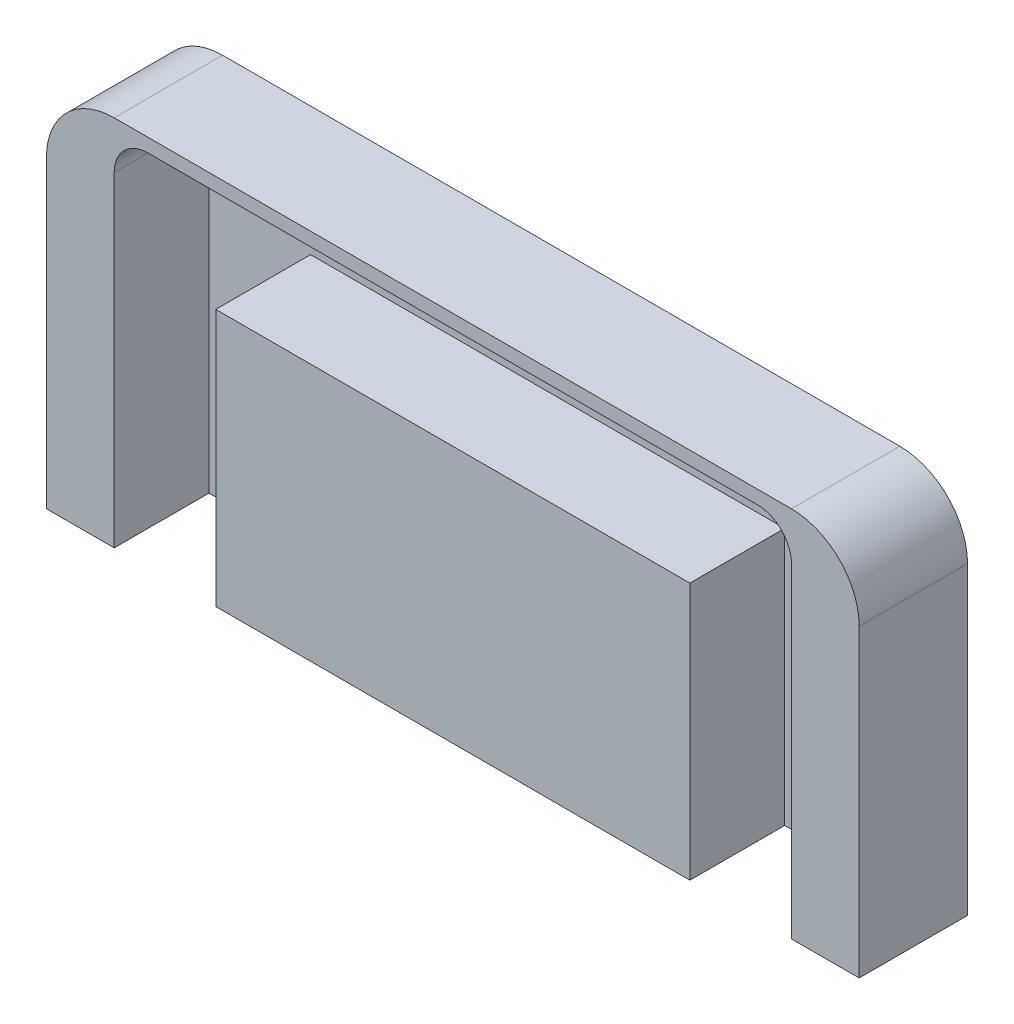
ISO-10303-21;
HEADER;
FILE_DESCRIPTION(('STEP AP214'),'2;1');
FILE_NAME('part.step','',(''),(''),'','','');
FILE_SCHEMA(('AUTOMOTIVE_DESIGN { 1 0 10303 214 1 1 1 1 }'));
ENDSEC;
DATA;
#1=APPLICATION_CONTEXT('core data for automotive mechanical design processes');
#2=APPLICATION_PROTOCOL_DEFINITION('international standard','automotive_design',2000,#1);
#3=PRODUCT_CONTEXT('',#1,'mechanical');
#4=PRODUCT('Part','Part','',(#3));
#5=PRODUCT_RELATED_PRODUCT_CATEGORY('part','',(#4));
#6=PRODUCT_DEFINITION_FORMATION('','',#4);
#7=PRODUCT_DEFINITION_CONTEXT('part definition',#1,'design');
#8=PRODUCT_DEFINITION('design','',#6,#7);
#9=PRODUCT_DEFINITION_SHAPE('','',#8);
#10=(LENGTH_UNIT() NAMED_UNIT(*) SI_UNIT(.MILLI.,.METRE.));
#11=(NAMED_UNIT(*) PLANE_ANGLE_UNIT() SI_UNIT($,.RADIAN.));
#12=(NAMED_UNIT(*) SI_UNIT($,.STERADIAN.) SOLID_ANGLE_UNIT());
#13=UNCERTAINTY_MEASURE_WITH_UNIT(LENGTH_MEASURE(1.E-05),#10,'distance_accuracy_value','');
#14=(GEOMETRIC_REPRESENTATION_CONTEXT(3) GLOBAL_UNCERTAINTY_ASSIGNED_CONTEXT((#13)) GLOBAL_UNIT_ASSIGNED_CONTEXT((#10,
#11,#12)) REPRESENTATION_CONTEXT('',''));
#15=CARTESIAN_POINT('',(0.,0.,0.));
#16=DIRECTION('',(0.,0.,1.));
#17=DIRECTION('',(1.,0.,0.));
#18=AXIS2_PLACEMENT_3D('',#15,#16,#17);
#19=CARTESIAN_POINT('',(0.,0.,3.2));
#20=DIRECTION('',(0.,0.,-1.));
#21=DIRECTION('',(-1.,0.,0.));
#22=AXIS2_PLACEMENT_3D('',#19,#20,#21);
#23=PLANE('',#22);
#24=DIRECTION('',(0.,1.,0.));
#25=VECTOR('',#24,1.);
#26=CARTESIAN_POINT('',(23.3144024959609,0.,3.2));
#27=LINE('',#26,#25);
#28=CARTESIAN_POINT('',(23.3144024959609,0.,3.2));
#29=VERTEX_POINT('',#28);
#30=CARTESIAN_POINT('',(23.3144024959609,9.,3.2));
#31=VERTEX_POINT('',#30);
#32=EDGE_CURVE('E198',#29,#31,#27,.T.);
#33=ORIENTED_EDGE('',*,*,#32,.T.);
#34=CARTESIAN_POINT('',(21.3144024959609,9.,3.2));
#35=DIRECTION('',(0.,0.,-1.));
#36=DIRECTION('',(-1.,0.,0.));
#37=AXIS2_PLACEMENT_3D('',#34,#35,#36);
#38=CIRCLE('',#37,2.);
#39=CARTESIAN_POINT('',(21.3144024959609,11.,3.2));
#40=VERTEX_POINT('',#39);
#41=EDGE_CURVE('E232',#31,#40,#38,.F.);
#42=ORIENTED_EDGE('',*,*,#41,.T.);
#43=DIRECTION('',(-1.,0.,0.));
#44=VECTOR('',#43,1.);
#45=CARTESIAN_POINT('',(-0.685597504039103,11.,3.2));
#46=LINE('',#45,#44);
#47=CARTESIAN_POINT('',(1.3144024959609,11.,3.2));
#48=VERTEX_POINT('',#47);
#49=EDGE_CURVE('E202',#40,#48,#46,.T.);
#50=ORIENTED_EDGE('',*,*,#49,.T.);
#51=CARTESIAN_POINT('',(1.3144024959609,9.,3.2));
#52=DIRECTION('',(0.,0.,-1.));
#53=DIRECTION('',(-1.,0.,0.));
#54=AXIS2_PLACEMENT_3D('',#51,#52,#53);
#55=CIRCLE('',#54,2.);
#56=CARTESIAN_POINT('',(-0.685597504039103,9.,3.2));
#57=VERTEX_POINT('',#56);
#58=EDGE_CURVE('E230',#48,#57,#55,.F.);
#59=ORIENTED_EDGE('',*,*,#58,.T.);
#60=DIRECTION('',(0.,-1.,0.));
#61=VECTOR('',#60,1.);
#62=CARTESIAN_POINT('',(-0.685597504039103,0.,3.2));
#63=LINE('',#62,#61);
#64=CARTESIAN_POINT('',(-0.685597504039103,0.,3.2));
#65=VERTEX_POINT('',#64);
#66=EDGE_CURVE('E191',#57,#65,#63,.T.);
#67=ORIENTED_EDGE('',*,*,#66,.T.);
#68=DIRECTION('',(1.,0.,0.));
#69=VECTOR('',#68,1.);
#70=CARTESIAN_POINT('',(-0.685597504039103,0.,3.2));
#71=LINE('',#70,#69);
#72=CARTESIAN_POINT('',(1.31440249596088,0.,3.2));
#73=VERTEX_POINT('',#72);
#74=EDGE_CURVE('E195',#65,#73,#71,.T.);
#75=ORIENTED_EDGE('',*,*,#74,.T.);
#76=DIRECTION('',(0.,-1.,0.));
#77=VECTOR('',#76,1.);
#78=CARTESIAN_POINT('',(1.31440249596088,7.6,3.2));
#79=LINE('',#78,#77);
#80=CARTESIAN_POINT('',(1.31440249596088,9.6,3.2));
#81=VERTEX_POINT('',#80);
#82=EDGE_CURVE('E182',#81,#73,#79,.T.);
#83=ORIENTED_EDGE('',*,*,#82,.F.);
#84=CARTESIAN_POINT('',(2.31440249596088,9.6,3.2));
#85=DIRECTION('',(0.,0.,-1.));
#86=DIRECTION('',(-1.,0.,0.));
#87=AXIS2_PLACEMENT_3D('',#84,#85,#86);
#88=CIRCLE('',#87,1.);
#89=CARTESIAN_POINT('',(2.31440249596088,10.6,3.2));
#90=VERTEX_POINT('',#89);
#91=EDGE_CURVE('E11',#81,#90,#88,.T.);
#92=ORIENTED_EDGE('',*,*,#91,.T.);
#93=DIRECTION('',(-1.,0.,0.));
#94=VECTOR('',#93,1.);
#95=CARTESIAN_POINT('',(21.3144024959609,10.6,3.2));
#96=LINE('',#95,#94);
#97=CARTESIAN_POINT('',(20.3144024959609,10.6,3.2));
#98=VERTEX_POINT('',#97);
#99=EDGE_CURVE('E176',#98,#90,#96,.T.);
#100=ORIENTED_EDGE('',*,*,#99,.F.);
#101=CARTESIAN_POINT('',(20.3144024959609,9.6,3.2));
#102=DIRECTION('',(0.,0.,-1.));
#103=DIRECTION('',(-1.,0.,0.));
#104=AXIS2_PLACEMENT_3D('',#101,#102,#103);
#105=CIRCLE('',#104,1.);
#106=CARTESIAN_POINT('',(21.3144024959609,9.6,3.2));
#107=VERTEX_POINT('',#106);
#108=EDGE_CURVE('E40',#98,#107,#105,.T.);
#109=ORIENTED_EDGE('',*,*,#108,.T.);
#110=DIRECTION('',(0.,1.,0.));
#111=VECTOR('',#110,1.);
#112=CARTESIAN_POINT('',(21.3144024959609,7.6,3.2));
#113=LINE('',#112,#111);
#114=CARTESIAN_POINT('',(21.3144024959609,0.,3.2));
#115=VERTEX_POINT('',#114);
#116=EDGE_CURVE('E186',#115,#107,#113,.T.);
#117=ORIENTED_EDGE('',*,*,#116,.F.);
#118=EDGE_CURVE('E193',#115,#29,#71,.T.);
#119=ORIENTED_EDGE('',*,*,#118,.T.);
#120=EDGE_LOOP('',(#33,#42,#50,#59,#67,#75,#83,#92,#100,#109,#117,#119));
#121=FACE_BOUND('',#120,.T.);
#122=ADVANCED_FACE('F32',(#121),#23,.F.);
#123=CARTESIAN_POINT('',(-0.685597504039103,0.,3.2));
#124=DIRECTION('',(1.,0.,0.));
#125=DIRECTION('',(0.,0.,-1.));
#126=AXIS2_PLACEMENT_3D('',#123,#124,#125);
#127=PLANE('',#126);
#128=ORIENTED_EDGE('',*,*,#66,.F.);
#129=DIRECTION('',(0.,0.,-1.));
#130=VECTOR('',#129,1.);
#131=CARTESIAN_POINT('',(-0.685597504039103,9.,3.2));
#132=LINE('',#131,#130);
#133=CARTESIAN_POINT('',(-0.685597504039103,9.,0.));
#134=VERTEX_POINT('',#133);
#135=EDGE_CURVE('E234',#57,#134,#132,.T.);
#136=ORIENTED_EDGE('',*,*,#135,.T.);
#137=DIRECTION('',(0.,-1.,0.));
#138=VECTOR('',#137,1.);
#139=CARTESIAN_POINT('',(-0.685597504039103,0.,0.));
#140=LINE('',#139,#138);
#141=CARTESIAN_POINT('',(-0.685597504039103,0.,0.));
#142=VERTEX_POINT('',#141);
#143=EDGE_CURVE('E181',#134,#142,#140,.T.);
#144=ORIENTED_EDGE('',*,*,#143,.T.);
#145=DIRECTION('',(0.,0.,-1.));
#146=VECTOR('',#145,1.);
#147=CARTESIAN_POINT('',(-0.685597504039103,0.,3.2));
#148=LINE('',#147,#146);
#149=EDGE_CURVE('E216',#65,#142,#148,.T.);
#150=ORIENTED_EDGE('',*,*,#149,.F.);
#151=EDGE_LOOP('',(#128,#136,#144,#150));
#152=FACE_BOUND('',#151,.T.);
#153=ADVANCED_FACE('F276',(#152),#127,.F.);
#154=CARTESIAN_POINT('',(-0.685597504039103,0.,3.2));
#155=DIRECTION('',(0.,1.,0.));
#156=DIRECTION('',(0.,0.,1.));
#157=AXIS2_PLACEMENT_3D('',#154,#155,#156);
#158=PLANE('',#157);
#159=ORIENTED_EDGE('',*,*,#118,.F.);
#160=DIRECTION('',(0.,0.,1.));
#161=VECTOR('',#160,1.);
#162=CARTESIAN_POINT('',(21.3144024959609,0.,0.4));
#163=LINE('',#162,#161);
#164=CARTESIAN_POINT('',(21.3144024959609,0.,0.4));
#165=VERTEX_POINT('',#164);
#166=EDGE_CURVE('E184',#165,#115,#163,.T.);
#167=ORIENTED_EDGE('',*,*,#166,.F.);
#168=DIRECTION('',(1.,0.,0.));
#169=VECTOR('',#168,1.);
#170=CARTESIAN_POINT('',(21.3144024959609,0.,0.4));
#171=LINE('',#170,#169);
#172=CARTESIAN_POINT('',(18.3144024959609,0.,0.4));
#173=VERTEX_POINT('',#172);
#174=EDGE_CURVE('E154',#173,#165,#171,.T.);
#175=ORIENTED_EDGE('',*,*,#174,.F.);
#176=DIRECTION('',(0.,0.,1.));
#177=VECTOR('',#176,1.);
#178=CARTESIAN_POINT('',(18.3144024959609,0.,0.4));
#179=LINE('',#178,#177);
#180=CARTESIAN_POINT('',(18.3144024959609,0.,3.2));
#181=VERTEX_POINT('',#180);
#182=EDGE_CURVE('E150',#173,#181,#179,.T.);
#183=ORIENTED_EDGE('',*,*,#182,.T.);
#184=CARTESIAN_POINT('',(4.31440249596088,0.,3.2));
#185=VERTEX_POINT('',#184);
#186=EDGE_CURVE('E199',#185,#181,#71,.T.);
#187=ORIENTED_EDGE('',*,*,#186,.F.);
#188=DIRECTION('',(0.,0.,1.));
#189=VECTOR('',#188,1.);
#190=CARTESIAN_POINT('',(4.31440249596088,0.,0.4));
#191=LINE('',#190,#189);
#192=CARTESIAN_POINT('',(4.31440249596088,0.,0.4));
#193=VERTEX_POINT('',#192);
#194=EDGE_CURVE('E328',#193,#185,#191,.T.);
#195=ORIENTED_EDGE('',*,*,#194,.F.);
#196=DIRECTION('',(1.,0.,0.));
#197=VECTOR('',#196,1.);
#198=CARTESIAN_POINT('',(1.31440249596088,0.,0.4));
#199=LINE('',#198,#197);
#200=CARTESIAN_POINT('',(1.31440249596088,0.,0.4));
#201=VERTEX_POINT('',#200);
#202=EDGE_CURVE('E333',#201,#193,#199,.T.);
#203=ORIENTED_EDGE('',*,*,#202,.F.);
#204=DIRECTION('',(0.,0.,1.));
#205=VECTOR('',#204,1.);
#206=CARTESIAN_POINT('',(1.31440249596088,0.,0.4));
#207=LINE('',#206,#205);
#208=EDGE_CURVE('E274',#201,#73,#207,.T.);
#209=ORIENTED_EDGE('',*,*,#208,.T.);
#210=ORIENTED_EDGE('',*,*,#74,.F.);
#211=ORIENTED_EDGE('',*,*,#149,.T.);
#212=DIRECTION('',(1.,0.,0.));
#213=VECTOR('',#212,1.);
#214=CARTESIAN_POINT('',(-0.685597504039103,0.,0.));
#215=LINE('',#214,#213);
#216=CARTESIAN_POINT('',(23.3144024959609,0.,0.));
#217=VERTEX_POINT('',#216);
#218=EDGE_CURVE('E207',#142,#217,#215,.T.);
#219=ORIENTED_EDGE('',*,*,#218,.T.);
#220=DIRECTION('',(0.,0.,-1.));
#221=VECTOR('',#220,1.);
#222=CARTESIAN_POINT('',(23.3144024959609,0.,3.2));
#223=LINE('',#222,#221);
#224=EDGE_CURVE('E205',#29,#217,#223,.T.);
#225=ORIENTED_EDGE('',*,*,#224,.F.);
#226=EDGE_LOOP('',(#159,#167,#175,#183,#187,#195,#203,#209,#210,#211,#219,#225));
#227=FACE_BOUND('',#226,.T.);
#228=ADVANCED_FACE('F272',(#227),#158,.F.);
#229=CARTESIAN_POINT('',(23.3144024959609,0.,3.2));
#230=DIRECTION('',(-1.,0.,0.));
#231=DIRECTION('',(0.,0.,1.));
#232=AXIS2_PLACEMENT_3D('',#229,#230,#231);
#233=PLANE('',#232);
#234=DIRECTION('',(0.,1.,0.));
#235=VECTOR('',#234,1.);
#236=CARTESIAN_POINT('',(23.3144024959609,0.,0.));
#237=LINE('',#236,#235);
#238=CARTESIAN_POINT('',(23.3144024959609,9.,0.));
#239=VERTEX_POINT('',#238);
#240=EDGE_CURVE('E209',#217,#239,#237,.T.);
#241=ORIENTED_EDGE('',*,*,#240,.T.);
#242=DIRECTION('',(0.,0.,-1.));
#243=VECTOR('',#242,1.);
#244=CARTESIAN_POINT('',(23.3144024959609,9.,3.2));
#245=LINE('',#244,#243);
#246=EDGE_CURVE('E228',#239,#31,#245,.F.);
#247=ORIENTED_EDGE('',*,*,#246,.T.);
#248=ORIENTED_EDGE('',*,*,#32,.F.);
#249=ORIENTED_EDGE('',*,*,#224,.T.);
#250=EDGE_LOOP('',(#241,#247,#248,#249));
#251=FACE_BOUND('',#250,.T.);
#252=ADVANCED_FACE('F287',(#251),#233,.F.);
#253=CARTESIAN_POINT('',(-0.685597504039103,11.,3.2));
#254=DIRECTION('',(0.,-1.,0.));
#255=DIRECTION('',(0.,0.,-1.));
#256=AXIS2_PLACEMENT_3D('',#253,#254,#255);
#257=PLANE('',#256);
#258=ORIENTED_EDGE('',*,*,#49,.F.);
#259=DIRECTION('',(0.,0.,-1.));
#260=VECTOR('',#259,1.);
#261=CARTESIAN_POINT('',(21.3144024959609,11.,3.2));
#262=LINE('',#261,#260);
#263=CARTESIAN_POINT('',(21.3144024959609,11.,0.));
#264=VERTEX_POINT('',#263);
#265=EDGE_CURVE('E221',#40,#264,#262,.T.);
#266=ORIENTED_EDGE('',*,*,#265,.T.);
#267=DIRECTION('',(-1.,0.,0.));
#268=VECTOR('',#267,1.);
#269=CARTESIAN_POINT('',(-0.685597504039103,11.,0.));
#270=LINE('',#269,#268);
#271=CARTESIAN_POINT('',(1.3144024959609,11.,0.));
#272=VERTEX_POINT('',#271);
#273=EDGE_CURVE('E194',#264,#272,#270,.T.);
#274=ORIENTED_EDGE('',*,*,#273,.T.);
#275=DIRECTION('',(0.,0.,-1.));
#276=VECTOR('',#275,1.);
#277=CARTESIAN_POINT('',(1.3144024959609,11.,3.2));
#278=LINE('',#277,#276);
#279=EDGE_CURVE('E219',#272,#48,#278,.F.);
#280=ORIENTED_EDGE('',*,*,#279,.T.);
#281=EDGE_LOOP('',(#258,#266,#274,#280));
#282=FACE_BOUND('',#281,.T.);
#283=ADVANCED_FACE('F295',(#282),#257,.F.);
#284=ORIENTED_EDGE('',*,*,#186,.T.);
#285=DIRECTION('',(0.,-1.,0.));
#286=VECTOR('',#285,1.);
#287=CARTESIAN_POINT('',(18.3144024959609,7.6,3.2));
#288=LINE('',#287,#286);
#289=CARTESIAN_POINT('',(18.3144024959609,7.6,3.2));
#290=VERTEX_POINT('',#289);
#291=EDGE_CURVE('E155',#290,#181,#288,.T.);
#292=ORIENTED_EDGE('',*,*,#291,.F.);
#293=DIRECTION('',(1.,0.,0.));
#294=VECTOR('',#293,1.);
#295=CARTESIAN_POINT('',(21.3144024959609,7.6,3.2));
#296=LINE('',#295,#294);
#297=CARTESIAN_POINT('',(4.31440249596088,7.6,3.2));
#298=VERTEX_POINT('',#297);
#299=EDGE_CURVE('E164',#298,#290,#296,.T.);
#300=ORIENTED_EDGE('',*,*,#299,.F.);
#301=DIRECTION('',(0.,1.,0.));
#302=VECTOR('',#301,1.);
#303=CARTESIAN_POINT('',(4.31440249596088,7.6,3.2));
#304=LINE('',#303,#302);
#305=EDGE_CURVE('E326',#185,#298,#304,.T.);
#306=ORIENTED_EDGE('',*,*,#305,.F.);
#307=EDGE_LOOP('',(#284,#292,#300,#306));
#308=FACE_BOUND('',#307,.T.);
#309=ADVANCED_FACE('F309',(#308),#23,.F.);
#310=CARTESIAN_POINT('',(0.,0.,0.));
#311=DIRECTION('',(0.,0.,-1.));
#312=DIRECTION('',(-1.,0.,0.));
#313=AXIS2_PLACEMENT_3D('',#310,#311,#312);
#314=PLANE('',#313);
#315=ORIENTED_EDGE('',*,*,#273,.F.);
#316=CARTESIAN_POINT('',(21.3144024959609,9.,0.));
#317=DIRECTION('',(0.,0.,-1.));
#318=DIRECTION('',(-1.,0.,0.));
#319=AXIS2_PLACEMENT_3D('',#316,#317,#318);
#320=CIRCLE('',#319,2.);
#321=EDGE_CURVE('E226',#264,#239,#320,.T.);
#322=ORIENTED_EDGE('',*,*,#321,.T.);
#323=ORIENTED_EDGE('',*,*,#240,.F.);
#324=ORIENTED_EDGE('',*,*,#218,.F.);
#325=ORIENTED_EDGE('',*,*,#143,.F.);
#326=CARTESIAN_POINT('',(1.3144024959609,9.,0.));
#327=DIRECTION('',(0.,0.,-1.));
#328=DIRECTION('',(-1.,0.,0.));
#329=AXIS2_PLACEMENT_3D('',#326,#327,#328);
#330=CIRCLE('',#329,2.);
#331=EDGE_CURVE('E224',#134,#272,#330,.T.);
#332=ORIENTED_EDGE('',*,*,#331,.T.);
#333=EDGE_LOOP('',(#315,#322,#323,#324,#325,#332));
#334=FACE_BOUND('',#333,.T.);
#335=ADVANCED_FACE('F283',(#334),#314,.T.);
#336=CARTESIAN_POINT('',(1.31440249596088,7.6,0.4));
#337=DIRECTION('',(-1.,0.,0.));
#338=DIRECTION('',(0.,0.,1.));
#339=AXIS2_PLACEMENT_3D('',#336,#337,#338);
#340=PLANE('',#339);
#341=DIRECTION('',(0.,-1.,0.));
#342=VECTOR('',#341,1.);
#343=CARTESIAN_POINT('',(1.31440249596088,7.6,0.4));
#344=LINE('',#343,#342);
#345=CARTESIAN_POINT('',(1.31440249596088,9.6,0.4));
#346=VERTEX_POINT('',#345);
#347=EDGE_CURVE('E172',#346,#201,#344,.T.);
#348=ORIENTED_EDGE('',*,*,#347,.F.);
#349=DIRECTION('',(0.,0.,1.));
#350=VECTOR('',#349,1.);
#351=CARTESIAN_POINT('',(1.31440249596088,9.6,3.2));
#352=LINE('',#351,#350);
#353=EDGE_CURVE('E247',#346,#81,#352,.T.);
#354=ORIENTED_EDGE('',*,*,#353,.T.);
#355=ORIENTED_EDGE('',*,*,#82,.T.);
#356=ORIENTED_EDGE('',*,*,#208,.F.);
#357=EDGE_LOOP('',(#348,#354,#355,#356));
#358=FACE_BOUND('',#357,.T.);
#359=ADVANCED_FACE('F265',(#358),#340,.F.);
#360=CARTESIAN_POINT('',(21.3144024959609,10.6,0.4));
#361=DIRECTION('',(0.,1.,0.));
#362=DIRECTION('',(0.,0.,1.));
#363=AXIS2_PLACEMENT_3D('',#360,#361,#362);
#364=PLANE('',#363);
#365=DIRECTION('',(-1.,0.,0.));
#366=VECTOR('',#365,1.);
#367=CARTESIAN_POINT('',(21.3144024959609,10.6,0.4));
#368=LINE('',#367,#366);
#369=CARTESIAN_POINT('',(20.3144024959609,10.6,0.4));
#370=VERTEX_POINT('',#369);
#371=CARTESIAN_POINT('',(2.31440249596088,10.6,0.4));
#372=VERTEX_POINT('',#371);
#373=EDGE_CURVE('E174',#370,#372,#368,.T.);
#374=ORIENTED_EDGE('',*,*,#373,.F.);
#375=DIRECTION('',(0.,0.,1.));
#376=VECTOR('',#375,1.);
#377=CARTESIAN_POINT('',(20.3144024959609,10.6,3.2));
#378=LINE('',#377,#376);
#379=EDGE_CURVE('E239',#370,#98,#378,.T.);
#380=ORIENTED_EDGE('',*,*,#379,.T.);
#381=ORIENTED_EDGE('',*,*,#99,.T.);
#382=DIRECTION('',(0.,0.,1.));
#383=VECTOR('',#382,1.);
#384=CARTESIAN_POINT('',(2.31440249596088,10.6,0.4));
#385=LINE('',#384,#383);
#386=EDGE_CURVE('E237',#90,#372,#385,.F.);
#387=ORIENTED_EDGE('',*,*,#386,.T.);
#388=EDGE_LOOP('',(#374,#380,#381,#387));
#389=FACE_BOUND('',#388,.T.);
#390=ADVANCED_FACE('F262',(#389),#364,.F.);
#391=CARTESIAN_POINT('',(21.3144024959609,7.6,0.4));
#392=DIRECTION('',(1.,0.,0.));
#393=DIRECTION('',(0.,0.,-1.));
#394=AXIS2_PLACEMENT_3D('',#391,#392,#393);
#395=PLANE('',#394);
#396=ORIENTED_EDGE('',*,*,#116,.T.);
#397=DIRECTION('',(0.,0.,1.));
#398=VECTOR('',#397,1.);
#399=CARTESIAN_POINT('',(21.3144024959609,9.6,0.4));
#400=LINE('',#399,#398);
#401=CARTESIAN_POINT('',(21.3144024959609,9.6,0.4));
#402=VERTEX_POINT('',#401);
#403=EDGE_CURVE('E242',#107,#402,#400,.F.);
#404=ORIENTED_EDGE('',*,*,#403,.T.);
#405=DIRECTION('',(0.,1.,0.));
#406=VECTOR('',#405,1.);
#407=CARTESIAN_POINT('',(21.3144024959609,7.6,0.4));
#408=LINE('',#407,#406);
#409=EDGE_CURVE('E171',#165,#402,#408,.T.);
#410=ORIENTED_EDGE('',*,*,#409,.F.);
#411=ORIENTED_EDGE('',*,*,#166,.T.);
#412=EDGE_LOOP('',(#396,#404,#410,#411));
#413=FACE_BOUND('',#412,.T.);
#414=ADVANCED_FACE('F255',(#413),#395,.F.);
#415=CARTESIAN_POINT('',(21.3144024959609,7.6,0.4));
#416=DIRECTION('',(0.,-1.,0.));
#417=DIRECTION('',(1.,0.,0.));
#418=AXIS2_PLACEMENT_3D('',#415,#416,#417);
#419=PLANE('',#418);
#420=ORIENTED_EDGE('',*,*,#299,.T.);
#421=DIRECTION('',(0.,0.,1.));
#422=VECTOR('',#421,1.);
#423=CARTESIAN_POINT('',(18.3144024959609,7.6,0.4));
#424=LINE('',#423,#422);
#425=CARTESIAN_POINT('',(18.3144024959609,7.6,0.4));
#426=VERTEX_POINT('',#425);
#427=EDGE_CURVE('E147',#426,#290,#424,.T.);
#428=ORIENTED_EDGE('',*,*,#427,.F.);
#429=DIRECTION('',(1.,0.,0.));
#430=VECTOR('',#429,1.);
#431=CARTESIAN_POINT('',(21.3144024959609,7.6,0.4));
#432=LINE('',#431,#430);
#433=CARTESIAN_POINT('',(4.31440249596088,7.6,0.4));
#434=VERTEX_POINT('',#433);
#435=EDGE_CURVE('E162',#434,#426,#432,.T.);
#436=ORIENTED_EDGE('',*,*,#435,.F.);
#437=DIRECTION('',(0.,0.,1.));
#438=VECTOR('',#437,1.);
#439=CARTESIAN_POINT('',(4.31440249596088,7.6,0.4));
#440=LINE('',#439,#438);
#441=EDGE_CURVE('E337',#434,#298,#440,.T.);
#442=ORIENTED_EDGE('',*,*,#441,.T.);
#443=EDGE_LOOP('',(#420,#428,#436,#442));
#444=FACE_BOUND('',#443,.T.);
#445=ADVANCED_FACE('F160',(#444),#419,.F.);
#446=CARTESIAN_POINT('',(0.,0.,0.4));
#447=DIRECTION('',(0.,0.,1.));
#448=DIRECTION('',(1.,0.,0.));
#449=AXIS2_PLACEMENT_3D('',#446,#447,#448);
#450=PLANE('',#449);
#451=ORIENTED_EDGE('',*,*,#409,.T.);
#452=CARTESIAN_POINT('',(20.3144024959609,9.6,0.4));
#453=DIRECTION('',(0.,0.,1.));
#454=DIRECTION('',(1.,0.,0.));
#455=AXIS2_PLACEMENT_3D('',#452,#453,#454);
#456=CIRCLE('',#455,1.);
#457=EDGE_CURVE('E245',#402,#370,#456,.T.);
#458=ORIENTED_EDGE('',*,*,#457,.T.);
#459=ORIENTED_EDGE('',*,*,#373,.T.);
#460=CARTESIAN_POINT('',(2.31440249596088,9.6,0.4));
#461=DIRECTION('',(0.,0.,1.));
#462=DIRECTION('',(1.,0.,0.));
#463=AXIS2_PLACEMENT_3D('',#460,#461,#462);
#464=CIRCLE('',#463,1.);
#465=EDGE_CURVE('E53',#372,#346,#464,.T.);
#466=ORIENTED_EDGE('',*,*,#465,.T.);
#467=ORIENTED_EDGE('',*,*,#347,.T.);
#468=ORIENTED_EDGE('',*,*,#202,.T.);
#469=DIRECTION('',(0.,1.,0.));
#470=VECTOR('',#469,1.);
#471=CARTESIAN_POINT('',(4.31440249596088,7.6,0.4));
#472=LINE('',#471,#470);
#473=EDGE_CURVE('E169',#193,#434,#472,.T.);
#474=ORIENTED_EDGE('',*,*,#473,.T.);
#475=ORIENTED_EDGE('',*,*,#435,.T.);
#476=DIRECTION('',(0.,-1.,0.));
#477=VECTOR('',#476,1.);
#478=CARTESIAN_POINT('',(18.3144024959609,7.6,0.4));
#479=LINE('',#478,#477);
#480=EDGE_CURVE('E144',#426,#173,#479,.T.);
#481=ORIENTED_EDGE('',*,*,#480,.T.);
#482=ORIENTED_EDGE('',*,*,#174,.T.);
#483=EDGE_LOOP('',(#451,#458,#459,#466,#467,#468,#474,#475,#481,#482));
#484=FACE_BOUND('',#483,.T.);
#485=ADVANCED_FACE('F167',(#484),#450,.T.);
#486=CARTESIAN_POINT('',(4.31440249596088,7.6,0.4));
#487=DIRECTION('',(1.,0.,0.));
#488=DIRECTION('',(0.,1.,0.));
#489=AXIS2_PLACEMENT_3D('',#486,#487,#488);
#490=PLANE('',#489);
#491=ORIENTED_EDGE('',*,*,#305,.T.);
#492=ORIENTED_EDGE('',*,*,#441,.F.);
#493=ORIENTED_EDGE('',*,*,#473,.F.);
#494=ORIENTED_EDGE('',*,*,#194,.T.);
#495=EDGE_LOOP('',(#491,#492,#493,#494));
#496=FACE_BOUND('',#495,.T.);
#497=ADVANCED_FACE('F340',(#496),#490,.F.);
#498=CARTESIAN_POINT('',(18.3144024959609,7.6,0.4));
#499=DIRECTION('',(-1.,0.,0.));
#500=DIRECTION('',(0.,-1.,0.));
#501=AXIS2_PLACEMENT_3D('',#498,#499,#500);
#502=PLANE('',#501);
#503=ORIENTED_EDGE('',*,*,#291,.T.);
#504=ORIENTED_EDGE('',*,*,#182,.F.);
#505=ORIENTED_EDGE('',*,*,#480,.F.);
#506=ORIENTED_EDGE('',*,*,#427,.T.);
#507=EDGE_LOOP('',(#503,#504,#505,#506));
#508=FACE_BOUND('',#507,.T.);
#509=ADVANCED_FACE('F146',(#508),#502,.F.);
#510=CARTESIAN_POINT('',(21.3144024959609,9.,3.2));
#511=DIRECTION('',(0.,0.,-1.));
#512=DIRECTION('',(-1.,0.,0.));
#513=AXIS2_PLACEMENT_3D('',#510,#511,#512);
#514=CYLINDRICAL_SURFACE('',#513,2.);
#515=ORIENTED_EDGE('',*,*,#41,.F.);
#516=ORIENTED_EDGE('',*,*,#246,.F.);
#517=ORIENTED_EDGE('',*,*,#321,.F.);
#518=ORIENTED_EDGE('',*,*,#265,.F.);
#519=EDGE_LOOP('',(#515,#516,#517,#518));
#520=FACE_BOUND('',#519,.T.);
#521=ADVANCED_FACE('F293',(#520),#514,.T.);
#522=CARTESIAN_POINT('',(1.3144024959609,9.,3.2));
#523=DIRECTION('',(0.,0.,-1.));
#524=DIRECTION('',(-1.,0.,0.));
#525=AXIS2_PLACEMENT_3D('',#522,#523,#524);
#526=CYLINDRICAL_SURFACE('',#525,2.);
#527=ORIENTED_EDGE('',*,*,#58,.F.);
#528=ORIENTED_EDGE('',*,*,#279,.F.);
#529=ORIENTED_EDGE('',*,*,#331,.F.);
#530=ORIENTED_EDGE('',*,*,#135,.F.);
#531=EDGE_LOOP('',(#527,#528,#529,#530));
#532=FACE_BOUND('',#531,.T.);
#533=ADVANCED_FACE('F299',(#532),#526,.T.);
#534=CARTESIAN_POINT('',(20.3144024959609,9.6,0.4));
#535=DIRECTION('',(0.,0.,-1.));
#536=DIRECTION('',(-1.,0.,0.));
#537=AXIS2_PLACEMENT_3D('',#534,#535,#536);
#538=CYLINDRICAL_SURFACE('',#537,1.);
#539=ORIENTED_EDGE('',*,*,#457,.F.);
#540=ORIENTED_EDGE('',*,*,#403,.F.);
#541=ORIENTED_EDGE('',*,*,#108,.F.);
#542=ORIENTED_EDGE('',*,*,#379,.F.);
#543=EDGE_LOOP('',(#539,#540,#541,#542));
#544=FACE_BOUND('',#543,.T.);
#545=ADVANCED_FACE('F259',(#544),#538,.F.);
#546=CARTESIAN_POINT('',(2.31440249596088,9.6,0.4));
#547=DIRECTION('',(0.,0.,-1.));
#548=DIRECTION('',(-1.,0.,0.));
#549=AXIS2_PLACEMENT_3D('',#546,#547,#548);
#550=CYLINDRICAL_SURFACE('',#549,1.);
#551=ORIENTED_EDGE('',*,*,#465,.F.);
#552=ORIENTED_EDGE('',*,*,#386,.F.);
#553=ORIENTED_EDGE('',*,*,#91,.F.);
#554=ORIENTED_EDGE('',*,*,#353,.F.);
#555=EDGE_LOOP('',(#551,#552,#553,#554));
#556=FACE_BOUND('',#555,.T.);
#557=ADVANCED_FACE('F34',(#556),#550,.F.);
#558=CLOSED_SHELL('',(#122,#153,#228,#252,#283,#309,#335,#359,#390,#414,#445,#485,#497,#509,
#521,#533,#545,#557));
#559=MANIFOLD_SOLID_BREP('B2',#558);
#560=ADVANCED_BREP_SHAPE_REPRESENTATION('',(#18,#559),#14);
#561=SHAPE_DEFINITION_REPRESENTATION(#9,#560);
ENDSEC;
END-ISO-10303-21;
